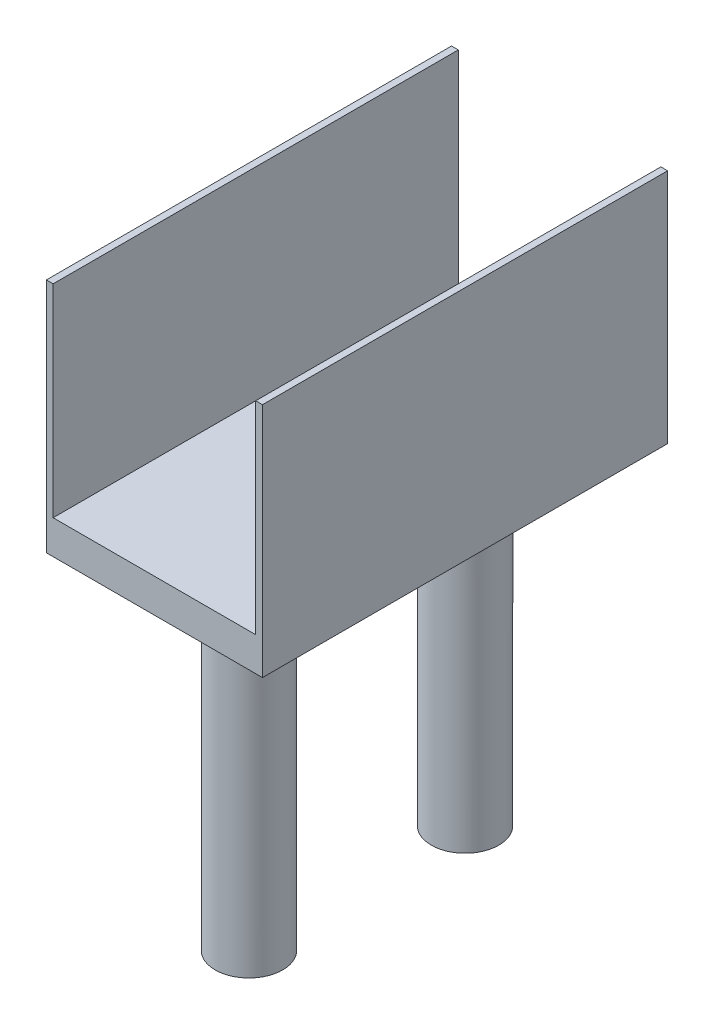
ISO-10303-21;
HEADER;
FILE_DESCRIPTION(('STEP AP214'),'2;1');
FILE_NAME('part.step','',(''),(''),'','','');
FILE_SCHEMA(('AUTOMOTIVE_DESIGN { 1 0 10303 214 1 1 1 1 }'));
ENDSEC;
DATA;
#1=APPLICATION_CONTEXT('core data for automotive mechanical design processes');
#2=APPLICATION_PROTOCOL_DEFINITION('international standard','automotive_design',2000,#1);
#3=PRODUCT_CONTEXT('',#1,'mechanical');
#4=PRODUCT('Part','Part','',(#3));
#5=PRODUCT_RELATED_PRODUCT_CATEGORY('part','',(#4));
#6=PRODUCT_DEFINITION_FORMATION('','',#4);
#7=PRODUCT_DEFINITION_CONTEXT('part definition',#1,'design');
#8=PRODUCT_DEFINITION('design','',#6,#7);
#9=PRODUCT_DEFINITION_SHAPE('','',#8);
#10=(LENGTH_UNIT() NAMED_UNIT(*) SI_UNIT(.MILLI.,.METRE.));
#11=(NAMED_UNIT(*) PLANE_ANGLE_UNIT() SI_UNIT($,.RADIAN.));
#12=(NAMED_UNIT(*) SI_UNIT($,.STERADIAN.) SOLID_ANGLE_UNIT());
#13=UNCERTAINTY_MEASURE_WITH_UNIT(LENGTH_MEASURE(1.E-05),#10,'distance_accuracy_value','');
#14=(GEOMETRIC_REPRESENTATION_CONTEXT(3) GLOBAL_UNCERTAINTY_ASSIGNED_CONTEXT((#13)) GLOBAL_UNIT_ASSIGNED_CONTEXT((#10,
#11,#12)) REPRESENTATION_CONTEXT('',''));
#15=CARTESIAN_POINT('',(0.,0.,0.));
#16=DIRECTION('',(0.,0.,1.));
#17=DIRECTION('',(1.,0.,0.));
#18=AXIS2_PLACEMENT_3D('',#15,#16,#17);
#19=CARTESIAN_POINT('',(0.,2.5,0.));
#20=DIRECTION('',(0.,1.,0.));
#21=DIRECTION('',(0.,0.,1.));
#22=AXIS2_PLACEMENT_3D('',#19,#20,#21);
#23=PLANE('',#22);
#24=DIRECTION('',(1.,0.,0.));
#25=VECTOR('',#24,1.);
#26=CARTESIAN_POINT('',(-16.,2.5,30.));
#27=LINE('',#26,#25);
#28=CARTESIAN_POINT('',(-15.,2.5,30.));
#29=VERTEX_POINT('',#28);
#30=CARTESIAN_POINT('',(15.,2.5,30.));
#31=VERTEX_POINT('',#30);
#32=EDGE_CURVE('E60',#29,#31,#27,.T.);
#33=ORIENTED_EDGE('',*,*,#32,.T.);
#34=DIRECTION('',(0.,0.,1.));
#35=VECTOR('',#34,1.);
#36=CARTESIAN_POINT('',(15.,2.5,30.));
#37=LINE('',#36,#35);
#38=CARTESIAN_POINT('',(15.,2.5,-30.));
#39=VERTEX_POINT('',#38);
#40=EDGE_CURVE('E55',#39,#31,#37,.T.);
#41=ORIENTED_EDGE('',*,*,#40,.F.);
#42=DIRECTION('',(-1.,0.,0.));
#43=VECTOR('',#42,1.);
#44=CARTESIAN_POINT('',(-16.,2.5,-30.));
#45=LINE('',#44,#43);
#46=CARTESIAN_POINT('',(-15.,2.5,-30.));
#47=VERTEX_POINT('',#46);
#48=EDGE_CURVE('E178',#39,#47,#45,.T.);
#49=ORIENTED_EDGE('',*,*,#48,.T.);
#50=DIRECTION('',(0.,0.,-1.));
#51=VECTOR('',#50,1.);
#52=CARTESIAN_POINT('',(-15.,2.5,-30.));
#53=LINE('',#52,#51);
#54=EDGE_CURVE('E144',#29,#47,#53,.T.);
#55=ORIENTED_EDGE('',*,*,#54,.F.);
#56=EDGE_LOOP('',(#33,#41,#49,#55));
#57=FACE_BOUND('',#56,.T.);
#58=ADVANCED_FACE('F39',(#57),#23,.T.);
#59=CARTESIAN_POINT('',(16.,2.5,-30.));
#60=DIRECTION('',(-1.,0.,0.));
#61=DIRECTION('',(0.,0.,1.));
#62=AXIS2_PLACEMENT_3D('',#59,#60,#61);
#63=PLANE('',#62);
#64=DIRECTION('',(0.,0.,-1.));
#65=VECTOR('',#64,1.);
#66=CARTESIAN_POINT('',(16.,-2.5,-30.));
#67=LINE('',#66,#65);
#68=CARTESIAN_POINT('',(16.,-2.5,30.));
#69=VERTEX_POINT('',#68);
#70=CARTESIAN_POINT('',(16.,-2.5,-30.));
#71=VERTEX_POINT('',#70);
#72=EDGE_CURVE('E110',#69,#71,#67,.T.);
#73=ORIENTED_EDGE('',*,*,#72,.T.);
#74=DIRECTION('',(0.,-1.,0.));
#75=VECTOR('',#74,1.);
#76=CARTESIAN_POINT('',(16.,2.5,-30.));
#77=LINE('',#76,#75);
#78=CARTESIAN_POINT('',(16.,32.5,-30.));
#79=VERTEX_POINT('',#78);
#80=EDGE_CURVE('E104',#79,#71,#77,.T.);
#81=ORIENTED_EDGE('',*,*,#80,.F.);
#82=DIRECTION('',(0.,0.,-1.));
#83=VECTOR('',#82,1.);
#84=CARTESIAN_POINT('',(16.,32.5,30.));
#85=LINE('',#84,#83);
#86=CARTESIAN_POINT('',(16.,32.5,30.));
#87=VERTEX_POINT('',#86);
#88=EDGE_CURVE('E108',#87,#79,#85,.T.);
#89=ORIENTED_EDGE('',*,*,#88,.F.);
#90=DIRECTION('',(0.,-1.,0.));
#91=VECTOR('',#90,1.);
#92=CARTESIAN_POINT('',(16.,2.5,30.));
#93=LINE('',#92,#91);
#94=EDGE_CURVE('E184',#87,#69,#93,.T.);
#95=ORIENTED_EDGE('',*,*,#94,.T.);
#96=EDGE_LOOP('',(#73,#81,#89,#95));
#97=FACE_BOUND('',#96,.T.);
#98=ADVANCED_FACE('F41',(#97),#63,.F.);
#99=CARTESIAN_POINT('',(-16.,2.5,-30.));
#100=DIRECTION('',(0.,0.,1.));
#101=DIRECTION('',(1.,0.,0.));
#102=AXIS2_PLACEMENT_3D('',#99,#100,#101);
#103=PLANE('',#102);
#104=DIRECTION('',(-1.,0.,0.));
#105=VECTOR('',#104,1.);
#106=CARTESIAN_POINT('',(-16.,-2.5,-30.));
#107=LINE('',#106,#105);
#108=CARTESIAN_POINT('',(-16.,-2.5,-30.));
#109=VERTEX_POINT('',#108);
#110=EDGE_CURVE('E187',#71,#109,#107,.T.);
#111=ORIENTED_EDGE('',*,*,#110,.T.);
#112=DIRECTION('',(0.,-1.,0.));
#113=VECTOR('',#112,1.);
#114=CARTESIAN_POINT('',(-16.,2.5,-30.));
#115=LINE('',#114,#113);
#116=CARTESIAN_POINT('',(-16.,32.5,-30.));
#117=VERTEX_POINT('',#116);
#118=EDGE_CURVE('E113',#117,#109,#115,.T.);
#119=ORIENTED_EDGE('',*,*,#118,.F.);
#120=DIRECTION('',(-1.,0.,0.));
#121=VECTOR('',#120,1.);
#122=CARTESIAN_POINT('',(-16.,32.5,-30.));
#123=LINE('',#122,#121);
#124=CARTESIAN_POINT('',(-15.,32.5,-30.));
#125=VERTEX_POINT('',#124);
#126=EDGE_CURVE('E155',#125,#117,#123,.T.);
#127=ORIENTED_EDGE('',*,*,#126,.F.);
#128=DIRECTION('',(0.,-1.,0.));
#129=VECTOR('',#128,1.);
#130=CARTESIAN_POINT('',(-15.,32.5,-30.));
#131=LINE('',#130,#129);
#132=EDGE_CURVE('E159',#125,#47,#131,.T.);
#133=ORIENTED_EDGE('',*,*,#132,.T.);
#134=ORIENTED_EDGE('',*,*,#48,.F.);
#135=DIRECTION('',(0.,-1.,0.));
#136=VECTOR('',#135,1.);
#137=CARTESIAN_POINT('',(15.,32.5,-30.));
#138=LINE('',#137,#136);
#139=CARTESIAN_POINT('',(15.,32.5,-30.));
#140=VERTEX_POINT('',#139);
#141=EDGE_CURVE('E119',#140,#39,#138,.T.);
#142=ORIENTED_EDGE('',*,*,#141,.F.);
#143=DIRECTION('',(-1.,0.,0.));
#144=VECTOR('',#143,1.);
#145=CARTESIAN_POINT('',(16.,32.5,-30.));
#146=LINE('',#145,#144);
#147=EDGE_CURVE('E116',#79,#140,#146,.T.);
#148=ORIENTED_EDGE('',*,*,#147,.F.);
#149=ORIENTED_EDGE('',*,*,#80,.T.);
#150=EDGE_LOOP('',(#111,#119,#127,#133,#134,#142,#148,#149));
#151=FACE_BOUND('',#150,.T.);
#152=ADVANCED_FACE('F117',(#151),#103,.F.);
#153=CARTESIAN_POINT('',(-16.,2.5,-30.));
#154=DIRECTION('',(1.,0.,0.));
#155=DIRECTION('',(0.,0.,-1.));
#156=AXIS2_PLACEMENT_3D('',#153,#154,#155);
#157=PLANE('',#156);
#158=DIRECTION('',(0.,0.,1.));
#159=VECTOR('',#158,1.);
#160=CARTESIAN_POINT('',(-16.,-2.5,-30.));
#161=LINE('',#160,#159);
#162=CARTESIAN_POINT('',(-16.,-2.5,30.));
#163=VERTEX_POINT('',#162);
#164=EDGE_CURVE('E190',#109,#163,#161,.T.);
#165=ORIENTED_EDGE('',*,*,#164,.T.);
#166=DIRECTION('',(0.,-1.,0.));
#167=VECTOR('',#166,1.);
#168=CARTESIAN_POINT('',(-16.,2.5,30.));
#169=LINE('',#168,#167);
#170=CARTESIAN_POINT('',(-16.,32.5,30.));
#171=VERTEX_POINT('',#170);
#172=EDGE_CURVE('E197',#171,#163,#169,.T.);
#173=ORIENTED_EDGE('',*,*,#172,.F.);
#174=DIRECTION('',(0.,0.,1.));
#175=VECTOR('',#174,1.);
#176=CARTESIAN_POINT('',(-16.,32.5,-30.));
#177=LINE('',#176,#175);
#178=EDGE_CURVE('E145',#117,#171,#177,.T.);
#179=ORIENTED_EDGE('',*,*,#178,.F.);
#180=ORIENTED_EDGE('',*,*,#118,.T.);
#181=EDGE_LOOP('',(#165,#173,#179,#180));
#182=FACE_BOUND('',#181,.T.);
#183=ADVANCED_FACE('F220',(#182),#157,.F.);
#184=CARTESIAN_POINT('',(-16.,2.5,30.));
#185=DIRECTION('',(0.,0.,-1.));
#186=DIRECTION('',(-1.,0.,0.));
#187=AXIS2_PLACEMENT_3D('',#184,#185,#186);
#188=PLANE('',#187);
#189=DIRECTION('',(1.,0.,0.));
#190=VECTOR('',#189,1.);
#191=CARTESIAN_POINT('',(-16.,-2.5,30.));
#192=LINE('',#191,#190);
#193=EDGE_CURVE('E181',#163,#69,#192,.T.);
#194=ORIENTED_EDGE('',*,*,#193,.T.);
#195=ORIENTED_EDGE('',*,*,#94,.F.);
#196=DIRECTION('',(1.,0.,0.));
#197=VECTOR('',#196,1.);
#198=CARTESIAN_POINT('',(16.,32.5,30.));
#199=LINE('',#198,#197);
#200=CARTESIAN_POINT('',(15.,32.5,30.));
#201=VERTEX_POINT('',#200);
#202=EDGE_CURVE('E128',#201,#87,#199,.T.);
#203=ORIENTED_EDGE('',*,*,#202,.F.);
#204=DIRECTION('',(0.,-1.,0.));
#205=VECTOR('',#204,1.);
#206=CARTESIAN_POINT('',(15.,32.5,30.));
#207=LINE('',#206,#205);
#208=EDGE_CURVE('E137',#201,#31,#207,.T.);
#209=ORIENTED_EDGE('',*,*,#208,.T.);
#210=ORIENTED_EDGE('',*,*,#32,.F.);
#211=DIRECTION('',(0.,-1.,0.));
#212=VECTOR('',#211,1.);
#213=CARTESIAN_POINT('',(-15.,32.5,30.));
#214=LINE('',#213,#212);
#215=CARTESIAN_POINT('',(-15.,32.5,30.));
#216=VERTEX_POINT('',#215);
#217=EDGE_CURVE('E166',#216,#29,#214,.T.);
#218=ORIENTED_EDGE('',*,*,#217,.F.);
#219=DIRECTION('',(1.,0.,0.));
#220=VECTOR('',#219,1.);
#221=CARTESIAN_POINT('',(-16.,32.5,30.));
#222=LINE('',#221,#220);
#223=EDGE_CURVE('E149',#171,#216,#222,.T.);
#224=ORIENTED_EDGE('',*,*,#223,.F.);
#225=ORIENTED_EDGE('',*,*,#172,.T.);
#226=EDGE_LOOP('',(#194,#195,#203,#209,#210,#218,#224,#225));
#227=FACE_BOUND('',#226,.T.);
#228=ADVANCED_FACE('F212',(#227),#188,.F.);
#229=CARTESIAN_POINT('',(0.,-2.5,0.));
#230=DIRECTION('',(0.,1.,0.));
#231=DIRECTION('',(0.,0.,1.));
#232=AXIS2_PLACEMENT_3D('',#229,#230,#231);
#233=PLANE('',#232);
#234=CARTESIAN_POINT('',(0.,-2.5,-16.));
#235=DIRECTION('',(0.,1.,0.));
#236=DIRECTION('',(0.,0.,1.));
#237=AXIS2_PLACEMENT_3D('',#234,#235,#236);
#238=CIRCLE('',#237,5.);
#239=CARTESIAN_POINT('',(0.,-2.5,-11.));
#240=VERTEX_POINT('',#239);
#241=EDGE_CURVE('E11',#240,#240,#238,.F.);
#242=ORIENTED_EDGE('',*,*,#241,.F.);
#243=EDGE_LOOP('',(#242));
#244=FACE_BOUND('',#243,.T.);
#245=CARTESIAN_POINT('',(0.,-2.5,16.));
#246=DIRECTION('',(0.,1.,0.));
#247=DIRECTION('',(0.,0.,1.));
#248=AXIS2_PLACEMENT_3D('',#245,#246,#247);
#249=CIRCLE('',#248,5.);
#250=CARTESIAN_POINT('',(0.,-2.5,21.));
#251=VERTEX_POINT('',#250);
#252=EDGE_CURVE('E48',#251,#251,#249,.F.);
#253=ORIENTED_EDGE('',*,*,#252,.F.);
#254=EDGE_LOOP('',(#253));
#255=FACE_BOUND('',#254,.T.);
#256=ORIENTED_EDGE('',*,*,#72,.F.);
#257=ORIENTED_EDGE('',*,*,#193,.F.);
#258=ORIENTED_EDGE('',*,*,#164,.F.);
#259=ORIENTED_EDGE('',*,*,#110,.F.);
#260=EDGE_LOOP('',(#256,#257,#258,#259));
#261=FACE_BOUND('',#260,.T.);
#262=ADVANCED_FACE('F209',(#244,#255,#261),#233,.F.);
#263=CARTESIAN_POINT('',(0.,-52.5,16.));
#264=DIRECTION('',(0.,1.,0.));
#265=DIRECTION('',(0.,0.,1.));
#266=AXIS2_PLACEMENT_3D('',#263,#264,#265);
#267=CYLINDRICAL_SURFACE('',#266,5.);
#268=CARTESIAN_POINT('',(0.,-52.5,16.));
#269=DIRECTION('',(0.,-1.,0.));
#270=DIRECTION('',(0.,0.,-1.));
#271=AXIS2_PLACEMENT_3D('',#268,#269,#270);
#272=CIRCLE('',#271,5.);
#273=CARTESIAN_POINT('',(0.,-52.5,11.));
#274=VERTEX_POINT('',#273);
#275=EDGE_CURVE('E174',#274,#274,#272,.T.);
#276=ORIENTED_EDGE('',*,*,#275,.F.);
#277=EDGE_LOOP('',(#276));
#278=FACE_BOUND('',#277,.T.);
#279=ORIENTED_EDGE('',*,*,#252,.T.);
#280=EDGE_LOOP('',(#279));
#281=FACE_BOUND('',#280,.T.);
#282=ADVANCED_FACE('F207',(#278,#281),#267,.T.);
#283=CARTESIAN_POINT('',(0.,-52.5,16.));
#284=DIRECTION('',(0.,-1.,0.));
#285=DIRECTION('',(0.,0.,-1.));
#286=AXIS2_PLACEMENT_3D('',#283,#284,#285);
#287=PLANE('',#286);
#288=ORIENTED_EDGE('',*,*,#275,.T.);
#289=EDGE_LOOP('',(#288));
#290=FACE_BOUND('',#289,.T.);
#291=ADVANCED_FACE('F276',(#290),#287,.T.);
#292=CARTESIAN_POINT('',(0.,-52.5,-16.));
#293=DIRECTION('',(0.,1.,0.));
#294=DIRECTION('',(0.,0.,1.));
#295=AXIS2_PLACEMENT_3D('',#292,#293,#294);
#296=CYLINDRICAL_SURFACE('',#295,5.);
#297=CARTESIAN_POINT('',(0.,-52.5,-16.));
#298=DIRECTION('',(0.,-1.,0.));
#299=DIRECTION('',(0.,0.,-1.));
#300=AXIS2_PLACEMENT_3D('',#297,#298,#299);
#301=CIRCLE('',#300,5.);
#302=CARTESIAN_POINT('',(0.,-52.5,-21.));
#303=VERTEX_POINT('',#302);
#304=EDGE_CURVE('E170',#303,#303,#301,.T.);
#305=ORIENTED_EDGE('',*,*,#304,.F.);
#306=EDGE_LOOP('',(#305));
#307=FACE_BOUND('',#306,.T.);
#308=ORIENTED_EDGE('',*,*,#241,.T.);
#309=EDGE_LOOP('',(#308));
#310=FACE_BOUND('',#309,.T.);
#311=ADVANCED_FACE('F283',(#307,#310),#296,.T.);
#312=CARTESIAN_POINT('',(0.,-52.5,-16.));
#313=DIRECTION('',(0.,-1.,0.));
#314=DIRECTION('',(0.,0.,-1.));
#315=AXIS2_PLACEMENT_3D('',#312,#313,#314);
#316=PLANE('',#315);
#317=ORIENTED_EDGE('',*,*,#304,.T.);
#318=EDGE_LOOP('',(#317));
#319=FACE_BOUND('',#318,.T.);
#320=ADVANCED_FACE('F290',(#319),#316,.T.);
#321=CARTESIAN_POINT('',(-15.,32.5,-30.));
#322=DIRECTION('',(-1.,0.,0.));
#323=DIRECTION('',(0.,0.,1.));
#324=AXIS2_PLACEMENT_3D('',#321,#322,#323);
#325=PLANE('',#324);
#326=ORIENTED_EDGE('',*,*,#54,.T.);
#327=ORIENTED_EDGE('',*,*,#132,.F.);
#328=DIRECTION('',(0.,0.,-1.));
#329=VECTOR('',#328,1.);
#330=CARTESIAN_POINT('',(-15.,32.5,-30.));
#331=LINE('',#330,#329);
#332=EDGE_CURVE('E152',#216,#125,#331,.T.);
#333=ORIENTED_EDGE('',*,*,#332,.F.);
#334=ORIENTED_EDGE('',*,*,#217,.T.);
#335=EDGE_LOOP('',(#326,#327,#333,#334));
#336=FACE_BOUND('',#335,.T.);
#337=ADVANCED_FACE('F228',(#336),#325,.F.);
#338=CARTESIAN_POINT('',(0.,32.5,0.));
#339=DIRECTION('',(0.,1.,0.));
#340=DIRECTION('',(0.,0.,1.));
#341=AXIS2_PLACEMENT_3D('',#338,#339,#340);
#342=PLANE('',#341);
#343=ORIENTED_EDGE('',*,*,#178,.T.);
#344=ORIENTED_EDGE('',*,*,#223,.T.);
#345=ORIENTED_EDGE('',*,*,#332,.T.);
#346=ORIENTED_EDGE('',*,*,#126,.T.);
#347=EDGE_LOOP('',(#343,#344,#345,#346));
#348=FACE_BOUND('',#347,.T.);
#349=ADVANCED_FACE('F223',(#348),#342,.T.);
#350=CARTESIAN_POINT('',(15.,32.5,30.));
#351=DIRECTION('',(1.,0.,0.));
#352=DIRECTION('',(0.,0.,-1.));
#353=AXIS2_PLACEMENT_3D('',#350,#351,#352);
#354=PLANE('',#353);
#355=ORIENTED_EDGE('',*,*,#40,.T.);
#356=ORIENTED_EDGE('',*,*,#208,.F.);
#357=DIRECTION('',(0.,0.,1.));
#358=VECTOR('',#357,1.);
#359=CARTESIAN_POINT('',(15.,32.5,30.));
#360=LINE('',#359,#358);
#361=EDGE_CURVE('E123',#140,#201,#360,.T.);
#362=ORIENTED_EDGE('',*,*,#361,.F.);
#363=ORIENTED_EDGE('',*,*,#141,.T.);
#364=EDGE_LOOP('',(#355,#356,#362,#363));
#365=FACE_BOUND('',#364,.T.);
#366=ADVANCED_FACE('F232',(#365),#354,.F.);
#367=CARTESIAN_POINT('',(0.,32.5,0.));
#368=DIRECTION('',(0.,1.,0.));
#369=DIRECTION('',(0.,0.,1.));
#370=AXIS2_PLACEMENT_3D('',#367,#368,#369);
#371=PLANE('',#370);
#372=ORIENTED_EDGE('',*,*,#88,.T.);
#373=ORIENTED_EDGE('',*,*,#147,.T.);
#374=ORIENTED_EDGE('',*,*,#361,.T.);
#375=ORIENTED_EDGE('',*,*,#202,.T.);
#376=EDGE_LOOP('',(#372,#373,#374,#375));
#377=FACE_BOUND('',#376,.T.);
#378=ADVANCED_FACE('F126',(#377),#371,.T.);
#379=CLOSED_SHELL('',(#58,#98,#152,#183,#228,#262,#282,#291,#311,#320,#337,#349,#366,#378));
#380=MANIFOLD_SOLID_BREP('B2',#379);
#381=ADVANCED_BREP_SHAPE_REPRESENTATION('',(#18,#380),#14);
#382=SHAPE_DEFINITION_REPRESENTATION(#9,#381);
ENDSEC;
END-ISO-10303-21;
